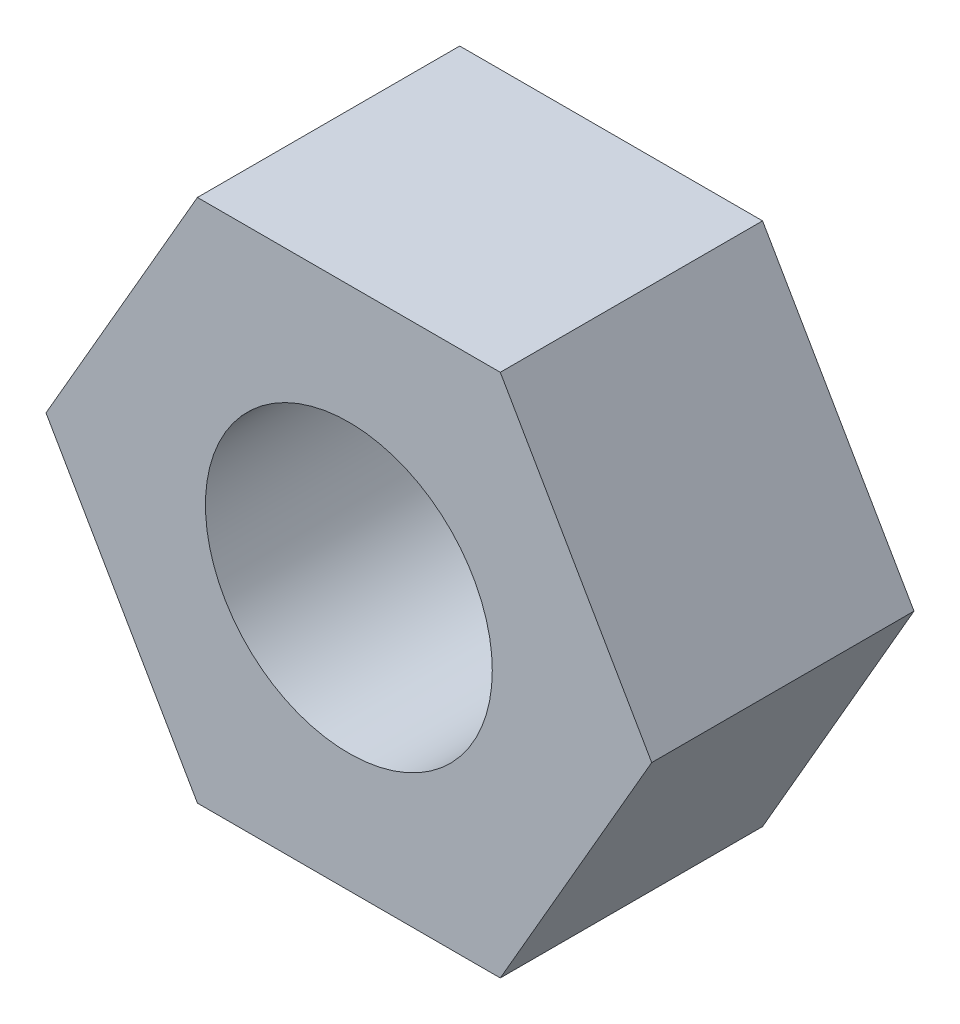
ISO-10303-21;
HEADER;
FILE_DESCRIPTION(('STEP AP214'),'2;1');
FILE_NAME('part.step','',(''),(''),'','','');
FILE_SCHEMA(('AUTOMOTIVE_DESIGN { 1 0 10303 214 1 1 1 1 }'));
ENDSEC;
DATA;
#1=APPLICATION_CONTEXT('core data for automotive mechanical design processes');
#2=APPLICATION_PROTOCOL_DEFINITION('international standard','automotive_design',2000,#1);
#3=PRODUCT_CONTEXT('',#1,'mechanical');
#4=PRODUCT('Part','Part','',(#3));
#5=PRODUCT_RELATED_PRODUCT_CATEGORY('part','',(#4));
#6=PRODUCT_DEFINITION_FORMATION('','',#4);
#7=PRODUCT_DEFINITION_CONTEXT('part definition',#1,'design');
#8=PRODUCT_DEFINITION('design','',#6,#7);
#9=PRODUCT_DEFINITION_SHAPE('','',#8);
#10=(LENGTH_UNIT() NAMED_UNIT(*) SI_UNIT(.MILLI.,.METRE.));
#11=(NAMED_UNIT(*) PLANE_ANGLE_UNIT() SI_UNIT($,.RADIAN.));
#12=(NAMED_UNIT(*) SI_UNIT($,.STERADIAN.) SOLID_ANGLE_UNIT());
#13=UNCERTAINTY_MEASURE_WITH_UNIT(LENGTH_MEASURE(1.E-05),#10,'distance_accuracy_value','');
#14=(GEOMETRIC_REPRESENTATION_CONTEXT(3) GLOBAL_UNCERTAINTY_ASSIGNED_CONTEXT((#13)) GLOBAL_UNIT_ASSIGNED_CONTEXT((#10,
#11,#12)) REPRESENTATION_CONTEXT('',''));
#15=CARTESIAN_POINT('',(0.,0.,0.));
#16=DIRECTION('',(0.,0.,1.));
#17=DIRECTION('',(1.,0.,0.));
#18=AXIS2_PLACEMENT_3D('',#15,#16,#17);
#19=CARTESIAN_POINT('',(3.6950417228136,-6.40000000000002,6.40000000000002));
#20=DIRECTION('',(-0.866025403784439,0.499999999999999,0.));
#21=DIRECTION('',(-0.5,-0.866025403784439,0.));
#22=AXIS2_PLACEMENT_3D('',#19,#20,#21);
#23=PLANE('',#22);
#24=DIRECTION('',(0.5,0.866025403784439,0.));
#25=VECTOR('',#24,1.);
#26=CARTESIAN_POINT('',(3.6950417228136,-6.40000000000002,0.));
#27=LINE('',#26,#25);
#28=CARTESIAN_POINT('',(3.6950417228136,-6.40000000000002,0.));
#29=VERTEX_POINT('',#28);
#30=CARTESIAN_POINT('',(7.39008344562719,0.,0.));
#31=VERTEX_POINT('',#30);
#32=EDGE_CURVE('E120',#29,#31,#27,.T.);
#33=ORIENTED_EDGE('',*,*,#32,.T.);
#34=DIRECTION('',(0.,0.,-1.));
#35=VECTOR('',#34,1.);
#36=CARTESIAN_POINT('',(7.39008344562719,0.,6.40000000000002));
#37=LINE('',#36,#35);
#38=CARTESIAN_POINT('',(7.39008344562719,0.,6.40000000000002));
#39=VERTEX_POINT('',#38);
#40=EDGE_CURVE('E11',#39,#31,#37,.T.);
#41=ORIENTED_EDGE('',*,*,#40,.F.);
#42=DIRECTION('',(0.5,0.866025403784439,0.));
#43=VECTOR('',#42,1.);
#44=CARTESIAN_POINT('',(3.6950417228136,-6.40000000000002,6.40000000000002));
#45=LINE('',#44,#43);
#46=CARTESIAN_POINT('',(3.6950417228136,-6.40000000000002,6.40000000000002));
#47=VERTEX_POINT('',#46);
#48=EDGE_CURVE('E131',#47,#39,#45,.T.);
#49=ORIENTED_EDGE('',*,*,#48,.F.);
#50=DIRECTION('',(0.,0.,-1.));
#51=VECTOR('',#50,1.);
#52=CARTESIAN_POINT('',(3.6950417228136,-6.40000000000002,6.40000000000002));
#53=LINE('',#52,#51);
#54=EDGE_CURVE('E116',#47,#29,#53,.T.);
#55=ORIENTED_EDGE('',*,*,#54,.T.);
#56=EDGE_LOOP('',(#33,#41,#49,#55));
#57=FACE_BOUND('',#56,.T.);
#58=ADVANCED_FACE('F36',(#57),#23,.F.);
#59=CARTESIAN_POINT('',(7.39008344562719,0.,6.40000000000002));
#60=DIRECTION('',(-0.866025403784439,-0.5,0.));
#61=DIRECTION('',(0.5,-0.866025403784438,0.));
#62=AXIS2_PLACEMENT_3D('',#59,#60,#61);
#63=PLANE('',#62);
#64=DIRECTION('',(-0.5,0.866025403784438,0.));
#65=VECTOR('',#64,1.);
#66=CARTESIAN_POINT('',(7.39008344562719,0.,0.));
#67=LINE('',#66,#65);
#68=CARTESIAN_POINT('',(3.6950417228136,6.40000000000002,0.));
#69=VERTEX_POINT('',#68);
#70=EDGE_CURVE('E123',#31,#69,#67,.T.);
#71=ORIENTED_EDGE('',*,*,#70,.T.);
#72=DIRECTION('',(0.,0.,-1.));
#73=VECTOR('',#72,1.);
#74=CARTESIAN_POINT('',(3.6950417228136,6.40000000000002,6.40000000000002));
#75=LINE('',#74,#73);
#76=CARTESIAN_POINT('',(3.6950417228136,6.40000000000002,6.40000000000002));
#77=VERTEX_POINT('',#76);
#78=EDGE_CURVE('E44',#77,#69,#75,.T.);
#79=ORIENTED_EDGE('',*,*,#78,.F.);
#80=DIRECTION('',(-0.5,0.866025403784438,0.));
#81=VECTOR('',#80,1.);
#82=CARTESIAN_POINT('',(7.39008344562719,0.,6.40000000000002));
#83=LINE('',#82,#81);
#84=EDGE_CURVE('E89',#39,#77,#83,.T.);
#85=ORIENTED_EDGE('',*,*,#84,.F.);
#86=ORIENTED_EDGE('',*,*,#40,.T.);
#87=EDGE_LOOP('',(#71,#79,#85,#86));
#88=FACE_BOUND('',#87,.T.);
#89=ADVANCED_FACE('F156',(#88),#63,.F.);
#90=CARTESIAN_POINT('',(3.6950417228136,6.40000000000002,6.40000000000002));
#91=DIRECTION('',(0.,-1.,0.));
#92=DIRECTION('',(0.,0.,-1.));
#93=AXIS2_PLACEMENT_3D('',#90,#91,#92);
#94=PLANE('',#93);
#95=DIRECTION('',(-1.,0.,0.));
#96=VECTOR('',#95,1.);
#97=CARTESIAN_POINT('',(3.6950417228136,6.40000000000002,0.));
#98=LINE('',#97,#96);
#99=CARTESIAN_POINT('',(-3.6950417228136,6.40000000000002,0.));
#100=VERTEX_POINT('',#99);
#101=EDGE_CURVE('E126',#69,#100,#98,.T.);
#102=ORIENTED_EDGE('',*,*,#101,.T.);
#103=DIRECTION('',(0.,0.,-1.));
#104=VECTOR('',#103,1.);
#105=CARTESIAN_POINT('',(-3.6950417228136,6.40000000000002,6.40000000000002));
#106=LINE('',#105,#104);
#107=CARTESIAN_POINT('',(-3.6950417228136,6.40000000000002,6.40000000000002));
#108=VERTEX_POINT('',#107);
#109=EDGE_CURVE('E111',#108,#100,#106,.T.);
#110=ORIENTED_EDGE('',*,*,#109,.F.);
#111=DIRECTION('',(-1.,0.,0.));
#112=VECTOR('',#111,1.);
#113=CARTESIAN_POINT('',(3.6950417228136,6.40000000000002,6.40000000000002));
#114=LINE('',#113,#112);
#115=EDGE_CURVE('E102',#77,#108,#114,.T.);
#116=ORIENTED_EDGE('',*,*,#115,.F.);
#117=ORIENTED_EDGE('',*,*,#78,.T.);
#118=EDGE_LOOP('',(#102,#110,#116,#117));
#119=FACE_BOUND('',#118,.T.);
#120=ADVANCED_FACE('F137',(#119),#94,.F.);
#121=CARTESIAN_POINT('',(-3.6950417228136,6.40000000000002,6.40000000000002));
#122=DIRECTION('',(0.866025403784439,-0.499999999999999,0.));
#123=DIRECTION('',(0.500000000000001,0.866025403784439,0.));
#124=AXIS2_PLACEMENT_3D('',#121,#122,#123);
#125=PLANE('',#124);
#126=DIRECTION('',(-0.500000000000001,-0.866025403784439,0.));
#127=VECTOR('',#126,1.);
#128=CARTESIAN_POINT('',(-3.6950417228136,6.40000000000002,0.));
#129=LINE('',#128,#127);
#130=CARTESIAN_POINT('',(-7.39008344562719,0.,0.));
#131=VERTEX_POINT('',#130);
#132=EDGE_CURVE('E110',#100,#131,#129,.T.);
#133=ORIENTED_EDGE('',*,*,#132,.T.);
#134=DIRECTION('',(0.,0.,-1.));
#135=VECTOR('',#134,1.);
#136=CARTESIAN_POINT('',(-7.39008344562719,0.,6.40000000000002));
#137=LINE('',#136,#135);
#138=CARTESIAN_POINT('',(-7.39008344562719,0.,6.40000000000002));
#139=VERTEX_POINT('',#138);
#140=EDGE_CURVE('E107',#139,#131,#137,.T.);
#141=ORIENTED_EDGE('',*,*,#140,.F.);
#142=DIRECTION('',(-0.500000000000001,-0.866025403784439,0.));
#143=VECTOR('',#142,1.);
#144=CARTESIAN_POINT('',(-3.6950417228136,6.40000000000002,6.40000000000002));
#145=LINE('',#144,#143);
#146=EDGE_CURVE('E96',#108,#139,#145,.T.);
#147=ORIENTED_EDGE('',*,*,#146,.F.);
#148=ORIENTED_EDGE('',*,*,#109,.T.);
#149=EDGE_LOOP('',(#133,#141,#147,#148));
#150=FACE_BOUND('',#149,.T.);
#151=ADVANCED_FACE('F108',(#150),#125,.F.);
#152=CARTESIAN_POINT('',(-7.39008344562719,0.,6.40000000000002));
#153=DIRECTION('',(0.866025403784439,0.500000000000001,0.));
#154=DIRECTION('',(-0.5,0.866025403784438,0.));
#155=AXIS2_PLACEMENT_3D('',#152,#153,#154);
#156=PLANE('',#155);
#157=DIRECTION('',(0.500000000000001,-0.866025403784438,0.));
#158=VECTOR('',#157,1.);
#159=CARTESIAN_POINT('',(-7.39008344562719,0.,0.));
#160=LINE('',#159,#158);
#161=CARTESIAN_POINT('',(-3.6950417228136,-6.40000000000002,0.));
#162=VERTEX_POINT('',#161);
#163=EDGE_CURVE('E75',#131,#162,#160,.T.);
#164=ORIENTED_EDGE('',*,*,#163,.T.);
#165=DIRECTION('',(0.,0.,-1.));
#166=VECTOR('',#165,1.);
#167=CARTESIAN_POINT('',(-3.6950417228136,-6.40000000000002,6.40000000000002));
#168=LINE('',#167,#166);
#169=CARTESIAN_POINT('',(-3.6950417228136,-6.40000000000002,6.40000000000002));
#170=VERTEX_POINT('',#169);
#171=EDGE_CURVE('E112',#170,#162,#168,.T.);
#172=ORIENTED_EDGE('',*,*,#171,.F.);
#173=DIRECTION('',(0.500000000000001,-0.866025403784438,0.));
#174=VECTOR('',#173,1.);
#175=CARTESIAN_POINT('',(-7.39008344562719,0.,6.40000000000002));
#176=LINE('',#175,#174);
#177=EDGE_CURVE('E100',#139,#170,#176,.T.);
#178=ORIENTED_EDGE('',*,*,#177,.F.);
#179=ORIENTED_EDGE('',*,*,#140,.T.);
#180=EDGE_LOOP('',(#164,#172,#178,#179));
#181=FACE_BOUND('',#180,.T.);
#182=ADVANCED_FACE('F114',(#181),#156,.F.);
#183=CARTESIAN_POINT('',(-3.6950417228136,-6.40000000000002,6.40000000000002));
#184=DIRECTION('',(0.,1.,0.));
#185=DIRECTION('',(0.,0.,1.));
#186=AXIS2_PLACEMENT_3D('',#183,#184,#185);
#187=PLANE('',#186);
#188=DIRECTION('',(1.,0.,0.));
#189=VECTOR('',#188,1.);
#190=CARTESIAN_POINT('',(-3.6950417228136,-6.40000000000002,0.));
#191=LINE('',#190,#189);
#192=EDGE_CURVE('E81',#162,#29,#191,.T.);
#193=ORIENTED_EDGE('',*,*,#192,.T.);
#194=ORIENTED_EDGE('',*,*,#54,.F.);
#195=DIRECTION('',(1.,0.,0.));
#196=VECTOR('',#195,1.);
#197=CARTESIAN_POINT('',(-3.6950417228136,-6.40000000000002,6.40000000000002));
#198=LINE('',#197,#196);
#199=EDGE_CURVE('E52',#170,#47,#198,.T.);
#200=ORIENTED_EDGE('',*,*,#199,.F.);
#201=ORIENTED_EDGE('',*,*,#171,.T.);
#202=EDGE_LOOP('',(#193,#194,#200,#201));
#203=FACE_BOUND('',#202,.T.);
#204=ADVANCED_FACE('F144',(#203),#187,.F.);
#205=CARTESIAN_POINT('',(7.39008344562719,0.,6.40000000000002));
#206=DIRECTION('',(0.,0.,1.));
#207=DIRECTION('',(1.,0.,0.));
#208=AXIS2_PLACEMENT_3D('',#205,#206,#207);
#209=PLANE('',#208);
#210=CARTESIAN_POINT('',(0.,0.,6.40000000000002));
#211=DIRECTION('',(0.,0.,1.));
#212=DIRECTION('',(1.,0.,0.));
#213=AXIS2_PLACEMENT_3D('',#210,#211,#212);
#214=CIRCLE('',#213,3.49999999999999);
#215=CARTESIAN_POINT('',(3.49999999999999,0.,6.40000000000002));
#216=VERTEX_POINT('',#215);
#217=EDGE_CURVE('E213',#216,#216,#214,.T.);
#218=ORIENTED_EDGE('',*,*,#217,.F.);
#219=EDGE_LOOP('',(#218));
#220=FACE_BOUND('',#219,.T.);
#221=ORIENTED_EDGE('',*,*,#48,.T.);
#222=ORIENTED_EDGE('',*,*,#84,.T.);
#223=ORIENTED_EDGE('',*,*,#115,.T.);
#224=ORIENTED_EDGE('',*,*,#146,.T.);
#225=ORIENTED_EDGE('',*,*,#177,.T.);
#226=ORIENTED_EDGE('',*,*,#199,.T.);
#227=EDGE_LOOP('',(#221,#222,#223,#224,#225,#226));
#228=FACE_BOUND('',#227,.T.);
#229=ADVANCED_FACE('F98',(#220,#228),#209,.T.);
#230=CARTESIAN_POINT('',(7.39008344562719,0.,0.));
#231=DIRECTION('',(0.,0.,1.));
#232=DIRECTION('',(1.,0.,0.));
#233=AXIS2_PLACEMENT_3D('',#230,#231,#232);
#234=PLANE('',#233);
#235=CARTESIAN_POINT('',(0.,0.,0.));
#236=DIRECTION('',(0.,0.,1.));
#237=DIRECTION('',(1.,0.,0.));
#238=AXIS2_PLACEMENT_3D('',#235,#236,#237);
#239=CIRCLE('',#238,3.5);
#240=CARTESIAN_POINT('',(3.5,0.,0.));
#241=VERTEX_POINT('',#240);
#242=EDGE_CURVE('E124',#241,#241,#239,.T.);
#243=ORIENTED_EDGE('',*,*,#242,.T.);
#244=EDGE_LOOP('',(#243));
#245=FACE_BOUND('',#244,.T.);
#246=ORIENTED_EDGE('',*,*,#32,.F.);
#247=ORIENTED_EDGE('',*,*,#192,.F.);
#248=ORIENTED_EDGE('',*,*,#163,.F.);
#249=ORIENTED_EDGE('',*,*,#132,.F.);
#250=ORIENTED_EDGE('',*,*,#101,.F.);
#251=ORIENTED_EDGE('',*,*,#70,.F.);
#252=EDGE_LOOP('',(#246,#247,#248,#249,#250,#251));
#253=FACE_BOUND('',#252,.T.);
#254=ADVANCED_FACE('F140',(#245,#253),#234,.F.);
#255=CARTESIAN_POINT('',(0.,0.,6.40000000000002));
#256=DIRECTION('',(0.,0.,1.));
#257=DIRECTION('',(1.,0.,0.));
#258=AXIS2_PLACEMENT_3D('',#255,#256,#257);
#259=CYLINDRICAL_SURFACE('',#258,3.49999999999999);
#260=ORIENTED_EDGE('',*,*,#242,.F.);
#261=EDGE_LOOP('',(#260));
#262=FACE_BOUND('',#261,.T.);
#263=ORIENTED_EDGE('',*,*,#217,.T.);
#264=EDGE_LOOP('',(#263));
#265=FACE_BOUND('',#264,.T.);
#266=ADVANCED_FACE('F193',(#262,#265),#259,.F.);
#267=CLOSED_SHELL('',(#58,#89,#120,#151,#182,#204,#229,#254,#266));
#268=MANIFOLD_SOLID_BREP('B2',#267);
#269=ADVANCED_BREP_SHAPE_REPRESENTATION('',(#18,#268),#14);
#270=SHAPE_DEFINITION_REPRESENTATION(#9,#269);
ENDSEC;
END-ISO-10303-21;
